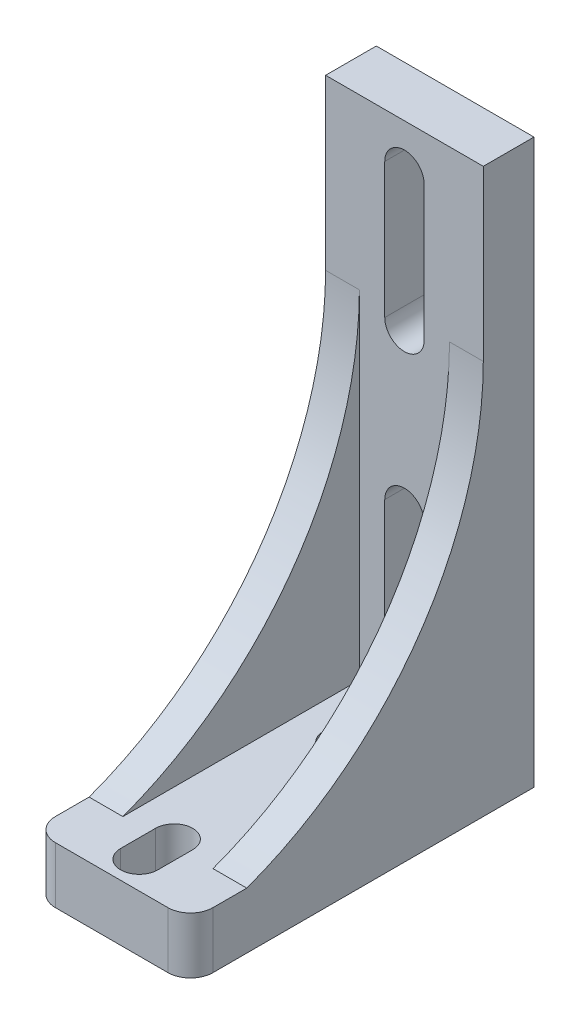
ISO-10303-21;
HEADER;
FILE_DESCRIPTION(('STEP AP214'),'2;1');
FILE_NAME('part.step','',(''),(''),'','','');
FILE_SCHEMA(('AUTOMOTIVE_DESIGN { 1 0 10303 214 1 1 1 1 }'));
ENDSEC;
DATA;
#1=APPLICATION_CONTEXT('core data for automotive mechanical design processes');
#2=APPLICATION_PROTOCOL_DEFINITION('international standard','automotive_design',2000,#1);
#3=PRODUCT_CONTEXT('',#1,'mechanical');
#4=PRODUCT('Part','Part','',(#3));
#5=PRODUCT_RELATED_PRODUCT_CATEGORY('part','',(#4));
#6=PRODUCT_DEFINITION_FORMATION('','',#4);
#7=PRODUCT_DEFINITION_CONTEXT('part definition',#1,'design');
#8=PRODUCT_DEFINITION('design','',#6,#7);
#9=PRODUCT_DEFINITION_SHAPE('','',#8);
#10=(LENGTH_UNIT() NAMED_UNIT(*) SI_UNIT(.MILLI.,.METRE.));
#11=(NAMED_UNIT(*) PLANE_ANGLE_UNIT() SI_UNIT($,.RADIAN.));
#12=(NAMED_UNIT(*) SI_UNIT($,.STERADIAN.) SOLID_ANGLE_UNIT());
#13=UNCERTAINTY_MEASURE_WITH_UNIT(LENGTH_MEASURE(1.E-05),#10,'distance_accuracy_value','');
#14=(GEOMETRIC_REPRESENTATION_CONTEXT(3) GLOBAL_UNCERTAINTY_ASSIGNED_CONTEXT((#13)) GLOBAL_UNIT_ASSIGNED_CONTEXT((#10,
#11,#12)) REPRESENTATION_CONTEXT('',''));
#15=CARTESIAN_POINT('',(0.,0.,0.));
#16=DIRECTION('',(0.,0.,1.));
#17=DIRECTION('',(1.,0.,0.));
#18=AXIS2_PLACEMENT_3D('',#15,#16,#17);
#19=CARTESIAN_POINT('',(50.6196668472011,35.0482499596085,5.99749994229783));
#20=DIRECTION('',(-1.,0.,0.));
#21=DIRECTION('',(0.,0.,1.));
#22=AXIS2_PLACEMENT_3D('',#19,#20,#21);
#23=CYLINDRICAL_SURFACE('',#22,31.997536321035);
#24=DIRECTION('',(-1.,0.,0.));
#25=VECTOR('',#24,1.);
#26=CARTESIAN_POINT('',(50.6196668472011,35.,-26.));
#27=LINE('',#26,#25);
#28=CARTESIAN_POINT('',(14.,35.,-26.));
#29=VERTEX_POINT('',#28);
#30=CARTESIAN_POINT('',(11.,34.9999999999909,-26.));
#31=VERTEX_POINT('',#30);
#32=EDGE_CURVE('E383',#29,#31,#27,.T.);
#33=ORIENTED_EDGE('',*,*,#32,.T.);
#34=CARTESIAN_POINT('',(11.,35.0482499596085,5.99749994229784));
#35=DIRECTION('',(-1.,0.,0.));
#36=DIRECTION('',(0.,0.,1.));
#37=AXIS2_PLACEMENT_3D('',#34,#35,#36);
#38=CIRCLE('',#37,31.997536321035);
#39=CARTESIAN_POINT('',(11.,5.,-5.));
#40=VERTEX_POINT('',#39);
#41=EDGE_CURVE('E492',#31,#40,#38,.T.);
#42=ORIENTED_EDGE('',*,*,#41,.T.);
#43=DIRECTION('',(-1.,0.,0.));
#44=VECTOR('',#43,1.);
#45=CARTESIAN_POINT('',(50.6196668472011,5.,-5.));
#46=LINE('',#45,#44);
#47=CARTESIAN_POINT('',(14.,5.,-5.));
#48=VERTEX_POINT('',#47);
#49=EDGE_CURVE('E374',#48,#40,#46,.T.);
#50=ORIENTED_EDGE('',*,*,#49,.F.);
#51=CARTESIAN_POINT('',(14.,35.0482499596085,5.99749994229784));
#52=DIRECTION('',(-1.,0.,0.));
#53=DIRECTION('',(0.,0.,1.));
#54=AXIS2_PLACEMENT_3D('',#51,#52,#53);
#55=CIRCLE('',#54,31.997536321035);
#56=EDGE_CURVE('E369',#29,#48,#55,.T.);
#57=ORIENTED_EDGE('',*,*,#56,.F.);
#58=EDGE_LOOP('',(#33,#42,#50,#57));
#59=FACE_BOUND('',#58,.T.);
#60=ADVANCED_FACE('F40',(#59),#23,.F.);
#61=CARTESIAN_POINT('',(3.,5.,-5.));
#62=VERTEX_POINT('',#61);
#63=CARTESIAN_POINT('',(0.,5.,-5.));
#64=VERTEX_POINT('',#63);
#65=EDGE_CURVE('E382',#62,#64,#46,.T.);
#66=ORIENTED_EDGE('',*,*,#65,.F.);
#67=CARTESIAN_POINT('',(3.,35.0482499596085,5.99749994229784));
#68=DIRECTION('',(1.,0.,0.));
#69=DIRECTION('',(0.,0.,-1.));
#70=AXIS2_PLACEMENT_3D('',#67,#68,#69);
#71=CIRCLE('',#70,31.997536321035);
#72=CARTESIAN_POINT('',(3.,34.9999999999954,-26.));
#73=VERTEX_POINT('',#72);
#74=EDGE_CURVE('E479',#62,#73,#71,.T.);
#75=ORIENTED_EDGE('',*,*,#74,.T.);
#76=CARTESIAN_POINT('',(0.,35.,-26.));
#77=VERTEX_POINT('',#76);
#78=EDGE_CURVE('E378',#73,#77,#27,.T.);
#79=ORIENTED_EDGE('',*,*,#78,.T.);
#80=CARTESIAN_POINT('',(0.,35.0482499596085,5.99749994229784));
#81=DIRECTION('',(1.,0.,0.));
#82=DIRECTION('',(0.,0.,1.));
#83=AXIS2_PLACEMENT_3D('',#80,#81,#82);
#84=CIRCLE('',#83,31.997536321035);
#85=EDGE_CURVE('E355',#64,#77,#84,.T.);
#86=ORIENTED_EDGE('',*,*,#85,.F.);
#87=EDGE_LOOP('',(#66,#75,#79,#86));
#88=FACE_BOUND('',#87,.T.);
#89=ADVANCED_FACE('F564',(#88),#23,.F.);
#90=CARTESIAN_POINT('',(0.,50.,0.));
#91=DIRECTION('',(0.,-1.,0.));
#92=DIRECTION('',(0.,0.,-1.));
#93=AXIS2_PLACEMENT_3D('',#90,#91,#92);
#94=PLANE('',#93);
#95=DIRECTION('',(0.,0.,-1.));
#96=VECTOR('',#95,1.);
#97=CARTESIAN_POINT('',(14.,50.,0.));
#98=LINE('',#97,#96);
#99=CARTESIAN_POINT('',(14.,50.,-26.));
#100=VERTEX_POINT('',#99);
#101=CARTESIAN_POINT('',(14.,50.,-30.5));
#102=VERTEX_POINT('',#101);
#103=EDGE_CURVE('E474',#100,#102,#98,.T.);
#104=ORIENTED_EDGE('',*,*,#103,.T.);
#105=DIRECTION('',(1.,0.,0.));
#106=VECTOR('',#105,1.);
#107=CARTESIAN_POINT('',(0.,50.,-30.5));
#108=LINE('',#107,#106);
#109=CARTESIAN_POINT('',(0.,50.,-30.5));
#110=VERTEX_POINT('',#109);
#111=EDGE_CURVE('E269',#110,#102,#108,.T.);
#112=ORIENTED_EDGE('',*,*,#111,.F.);
#113=DIRECTION('',(0.,0.,1.));
#114=VECTOR('',#113,1.);
#115=CARTESIAN_POINT('',(0.,50.,0.));
#116=LINE('',#115,#114);
#117=CARTESIAN_POINT('',(0.,50.,-26.));
#118=VERTEX_POINT('',#117);
#119=EDGE_CURVE('E471',#110,#118,#116,.T.);
#120=ORIENTED_EDGE('',*,*,#119,.T.);
#121=DIRECTION('',(-1.,0.,0.));
#122=VECTOR('',#121,1.);
#123=CARTESIAN_POINT('',(65.9711458407451,50.,-26.));
#124=LINE('',#123,#122);
#125=EDGE_CURVE('E464',#100,#118,#124,.T.);
#126=ORIENTED_EDGE('',*,*,#125,.F.);
#127=EDGE_LOOP('',(#104,#112,#120,#126));
#128=FACE_BOUND('',#127,.T.);
#129=ADVANCED_FACE('F601',(#128),#94,.F.);
#130=CARTESIAN_POINT('',(0.,0.,0.));
#131=DIRECTION('',(0.,-1.,0.));
#132=DIRECTION('',(0.,0.,-1.));
#133=AXIS2_PLACEMENT_3D('',#130,#131,#132);
#134=PLANE('',#133);
#135=CARTESIAN_POINT('',(7.00000000000001,0.,-20.45));
#136=DIRECTION('',(0.,-1.,0.));
#137=DIRECTION('',(0.,0.,-1.));
#138=AXIS2_PLACEMENT_3D('',#135,#136,#137);
#139=CIRCLE('',#138,1.65);
#140=CARTESIAN_POINT('',(8.65,0.,-20.45));
#141=VERTEX_POINT('',#140);
#142=CARTESIAN_POINT('',(5.35,0.,-20.45));
#143=VERTEX_POINT('',#142);
#144=EDGE_CURVE('E56',#141,#143,#139,.T.);
#145=ORIENTED_EDGE('',*,*,#144,.F.);
#146=DIRECTION('',(0.,0.,1.));
#147=VECTOR('',#146,1.);
#148=CARTESIAN_POINT('',(8.65,0.,-20.45));
#149=LINE('',#148,#147);
#150=CARTESIAN_POINT('',(8.65,0.,-23.55));
#151=VERTEX_POINT('',#150);
#152=EDGE_CURVE('E252',#151,#141,#149,.T.);
#153=ORIENTED_EDGE('',*,*,#152,.F.);
#154=CARTESIAN_POINT('',(7.00000000000001,0.,-23.55));
#155=DIRECTION('',(0.,-1.,0.));
#156=DIRECTION('',(0.,0.,-1.));
#157=AXIS2_PLACEMENT_3D('',#154,#155,#156);
#158=CIRCLE('',#157,1.65);
#159=CARTESIAN_POINT('',(5.35000000000001,0.,-23.55));
#160=VERTEX_POINT('',#159);
#161=EDGE_CURVE('E233',#160,#151,#158,.T.);
#162=ORIENTED_EDGE('',*,*,#161,.F.);
#163=DIRECTION('',(0.,0.,-1.));
#164=VECTOR('',#163,1.);
#165=CARTESIAN_POINT('',(5.35,0.,-20.45));
#166=LINE('',#165,#164);
#167=EDGE_CURVE('E244',#143,#160,#166,.T.);
#168=ORIENTED_EDGE('',*,*,#167,.F.);
#169=EDGE_LOOP('',(#145,#153,#162,#168));
#170=FACE_BOUND('',#169,.T.);
#171=CARTESIAN_POINT('',(7.00000000000001,0.,-2.45));
#172=DIRECTION('',(0.,-1.,0.));
#173=DIRECTION('',(0.,0.,-1.));
#174=AXIS2_PLACEMENT_3D('',#171,#172,#173);
#175=CIRCLE('',#174,1.65);
#176=CARTESIAN_POINT('',(8.65,0.,-2.45));
#177=VERTEX_POINT('',#176);
#178=CARTESIAN_POINT('',(5.35,0.,-2.45));
#179=VERTEX_POINT('',#178);
#180=EDGE_CURVE('E64',#177,#179,#175,.T.);
#181=ORIENTED_EDGE('',*,*,#180,.F.);
#182=DIRECTION('',(0.,0.,1.));
#183=VECTOR('',#182,1.);
#184=CARTESIAN_POINT('',(8.65,0.,-2.45));
#185=LINE('',#184,#183);
#186=CARTESIAN_POINT('',(8.65,0.,-5.55));
#187=VERTEX_POINT('',#186);
#188=EDGE_CURVE('E293',#187,#177,#185,.T.);
#189=ORIENTED_EDGE('',*,*,#188,.F.);
#190=CARTESIAN_POINT('',(7.00000000000001,0.,-5.55));
#191=DIRECTION('',(0.,-1.,0.));
#192=DIRECTION('',(0.,0.,-1.));
#193=AXIS2_PLACEMENT_3D('',#190,#191,#192);
#194=CIRCLE('',#193,1.65);
#195=CARTESIAN_POINT('',(5.35000000000001,0.,-5.55));
#196=VERTEX_POINT('',#195);
#197=EDGE_CURVE('E289',#196,#187,#194,.T.);
#198=ORIENTED_EDGE('',*,*,#197,.F.);
#199=DIRECTION('',(0.,0.,-1.));
#200=VECTOR('',#199,1.);
#201=CARTESIAN_POINT('',(5.35,0.,-2.45));
#202=LINE('',#201,#200);
#203=EDGE_CURVE('E285',#179,#196,#202,.T.);
#204=ORIENTED_EDGE('',*,*,#203,.F.);
#205=EDGE_LOOP('',(#181,#189,#198,#204));
#206=FACE_BOUND('',#205,.T.);
#207=DIRECTION('',(1.,0.,0.));
#208=VECTOR('',#207,1.);
#209=CARTESIAN_POINT('',(0.,0.,-30.5));
#210=LINE('',#209,#208);
#211=CARTESIAN_POINT('',(0.,0.,-30.5));
#212=VERTEX_POINT('',#211);
#213=CARTESIAN_POINT('',(14.,0.,-30.5));
#214=VERTEX_POINT('',#213);
#215=EDGE_CURVE('E312',#212,#214,#210,.T.);
#216=ORIENTED_EDGE('',*,*,#215,.T.);
#217=DIRECTION('',(0.,0.,-1.));
#218=VECTOR('',#217,1.);
#219=CARTESIAN_POINT('',(14.,0.,0.));
#220=LINE('',#219,#218);
#221=CARTESIAN_POINT('',(14.,0.,-2.));
#222=VERTEX_POINT('',#221);
#223=EDGE_CURVE('E475',#222,#214,#220,.T.);
#224=ORIENTED_EDGE('',*,*,#223,.F.);
#225=CARTESIAN_POINT('',(12.,0.,-2.));
#226=DIRECTION('',(0.,-1.,0.));
#227=DIRECTION('',(0.,0.,-1.));
#228=AXIS2_PLACEMENT_3D('',#225,#226,#227);
#229=CIRCLE('',#228,2.);
#230=CARTESIAN_POINT('',(12.,0.,0.));
#231=VERTEX_POINT('',#230);
#232=EDGE_CURVE('E504',#222,#231,#229,.T.);
#233=ORIENTED_EDGE('',*,*,#232,.T.);
#234=DIRECTION('',(1.,0.,0.));
#235=VECTOR('',#234,1.);
#236=CARTESIAN_POINT('',(0.,0.,0.));
#237=LINE('',#236,#235);
#238=CARTESIAN_POINT('',(2.,0.,0.));
#239=VERTEX_POINT('',#238);
#240=EDGE_CURVE('E482',#239,#231,#237,.T.);
#241=ORIENTED_EDGE('',*,*,#240,.F.);
#242=CARTESIAN_POINT('',(2.,0.,-2.));
#243=DIRECTION('',(0.,-1.,0.));
#244=DIRECTION('',(0.,0.,-1.));
#245=AXIS2_PLACEMENT_3D('',#242,#243,#244);
#246=CIRCLE('',#245,2.);
#247=CARTESIAN_POINT('',(0.,0.,-2.));
#248=VERTEX_POINT('',#247);
#249=EDGE_CURVE('E500',#239,#248,#246,.T.);
#250=ORIENTED_EDGE('',*,*,#249,.T.);
#251=DIRECTION('',(0.,0.,1.));
#252=VECTOR('',#251,1.);
#253=CARTESIAN_POINT('',(0.,0.,0.));
#254=LINE('',#253,#252);
#255=EDGE_CURVE('E456',#212,#248,#254,.T.);
#256=ORIENTED_EDGE('',*,*,#255,.F.);
#257=EDGE_LOOP('',(#216,#224,#233,#241,#250,#256));
#258=FACE_BOUND('',#257,.T.);
#259=ADVANCED_FACE('F249',(#170,#206,#258),#134,.T.);
#260=CARTESIAN_POINT('',(0.,50.,0.));
#261=DIRECTION('',(1.,0.,0.));
#262=DIRECTION('',(0.,0.,-1.));
#263=AXIS2_PLACEMENT_3D('',#260,#261,#262);
#264=PLANE('',#263);
#265=ORIENTED_EDGE('',*,*,#119,.F.);
#266=DIRECTION('',(0.,1.,0.));
#267=VECTOR('',#266,1.);
#268=CARTESIAN_POINT('',(0.,-14.0089257261219,-30.5));
#269=LINE('',#268,#267);
#270=EDGE_CURVE('E320',#212,#110,#269,.T.);
#271=ORIENTED_EDGE('',*,*,#270,.F.);
#272=ORIENTED_EDGE('',*,*,#255,.T.);
#273=DIRECTION('',(0.,-1.,0.));
#274=VECTOR('',#273,1.);
#275=CARTESIAN_POINT('',(0.,50.,-2.));
#276=LINE('',#275,#274);
#277=CARTESIAN_POINT('',(0.,5.,-2.));
#278=VERTEX_POINT('',#277);
#279=EDGE_CURVE('E49',#248,#278,#276,.F.);
#280=ORIENTED_EDGE('',*,*,#279,.T.);
#281=DIRECTION('',(0.,0.,1.));
#282=VECTOR('',#281,1.);
#283=CARTESIAN_POINT('',(0.,5.,0.));
#284=LINE('',#283,#282);
#285=EDGE_CURVE('E460',#64,#278,#284,.T.);
#286=ORIENTED_EDGE('',*,*,#285,.F.);
#287=ORIENTED_EDGE('',*,*,#85,.T.);
#288=DIRECTION('',(0.,-1.,0.));
#289=VECTOR('',#288,1.);
#290=CARTESIAN_POINT('',(0.,50.,-26.));
#291=LINE('',#290,#289);
#292=EDGE_CURVE('E420',#118,#77,#291,.T.);
#293=ORIENTED_EDGE('',*,*,#292,.F.);
#294=EDGE_LOOP('',(#265,#271,#272,#280,#286,#287,#293));
#295=FACE_BOUND('',#294,.T.);
#296=ADVANCED_FACE('F524',(#295),#264,.F.);
#297=CARTESIAN_POINT('',(0.,50.,0.));
#298=DIRECTION('',(0.,0.,-1.));
#299=DIRECTION('',(-1.,0.,0.));
#300=AXIS2_PLACEMENT_3D('',#297,#298,#299);
#301=PLANE('',#300);
#302=ORIENTED_EDGE('',*,*,#240,.T.);
#303=DIRECTION('',(0.,-1.,0.));
#304=VECTOR('',#303,1.);
#305=CARTESIAN_POINT('',(12.,50.,0.));
#306=LINE('',#305,#304);
#307=CARTESIAN_POINT('',(12.,5.,0.));
#308=VERTEX_POINT('',#307);
#309=EDGE_CURVE('E511',#231,#308,#306,.F.);
#310=ORIENTED_EDGE('',*,*,#309,.T.);
#311=DIRECTION('',(-1.,0.,0.));
#312=VECTOR('',#311,1.);
#313=CARTESIAN_POINT('',(65.9711458407451,5.,0.));
#314=LINE('',#313,#312);
#315=CARTESIAN_POINT('',(2.,5.,0.));
#316=VERTEX_POINT('',#315);
#317=EDGE_CURVE('E453',#308,#316,#314,.T.);
#318=ORIENTED_EDGE('',*,*,#317,.T.);
#319=DIRECTION('',(0.,-1.,0.));
#320=VECTOR('',#319,1.);
#321=CARTESIAN_POINT('',(2.,50.,0.));
#322=LINE('',#321,#320);
#323=EDGE_CURVE('E507',#316,#239,#322,.T.);
#324=ORIENTED_EDGE('',*,*,#323,.T.);
#325=EDGE_LOOP('',(#302,#310,#318,#324));
#326=FACE_BOUND('',#325,.T.);
#327=ADVANCED_FACE('F538',(#326),#301,.F.);
#328=CARTESIAN_POINT('',(14.,50.,0.));
#329=DIRECTION('',(-1.,0.,0.));
#330=DIRECTION('',(0.,0.,1.));
#331=AXIS2_PLACEMENT_3D('',#328,#329,#330);
#332=PLANE('',#331);
#333=ORIENTED_EDGE('',*,*,#223,.T.);
#334=DIRECTION('',(0.,1.,0.));
#335=VECTOR('',#334,1.);
#336=CARTESIAN_POINT('',(14.,-14.0089257261219,-30.5));
#337=LINE('',#336,#335);
#338=EDGE_CURVE('E316',#214,#102,#337,.T.);
#339=ORIENTED_EDGE('',*,*,#338,.T.);
#340=ORIENTED_EDGE('',*,*,#103,.F.);
#341=DIRECTION('',(0.,1.,0.));
#342=VECTOR('',#341,1.);
#343=CARTESIAN_POINT('',(14.,50.,-26.));
#344=LINE('',#343,#342);
#345=EDGE_CURVE('E449',#29,#100,#344,.T.);
#346=ORIENTED_EDGE('',*,*,#345,.F.);
#347=ORIENTED_EDGE('',*,*,#56,.T.);
#348=DIRECTION('',(0.,0.,-1.));
#349=VECTOR('',#348,1.);
#350=CARTESIAN_POINT('',(14.,5.,0.));
#351=LINE('',#350,#349);
#352=CARTESIAN_POINT('',(14.,5.,-2.));
#353=VERTEX_POINT('',#352);
#354=EDGE_CURVE('E452',#353,#48,#351,.T.);
#355=ORIENTED_EDGE('',*,*,#354,.F.);
#356=DIRECTION('',(0.,-1.,0.));
#357=VECTOR('',#356,1.);
#358=CARTESIAN_POINT('',(14.,50.,-2.));
#359=LINE('',#358,#357);
#360=EDGE_CURVE('E496',#353,#222,#359,.T.);
#361=ORIENTED_EDGE('',*,*,#360,.T.);
#362=EDGE_LOOP('',(#333,#339,#340,#346,#347,#355,#361));
#363=FACE_BOUND('',#362,.T.);
#364=ADVANCED_FACE('F548',(#363),#332,.F.);
#365=CARTESIAN_POINT('',(65.9711458407451,5.,0.));
#366=DIRECTION('',(0.,-1.,0.));
#367=DIRECTION('',(0.,0.,-1.));
#368=AXIS2_PLACEMENT_3D('',#365,#366,#367);
#369=PLANE('',#368);
#370=DIRECTION('',(0.,0.,-1.));
#371=VECTOR('',#370,1.);
#372=CARTESIAN_POINT('',(8.65,5.,-20.45));
#373=LINE('',#372,#371);
#374=CARTESIAN_POINT('',(8.65,5.,-20.45));
#375=VERTEX_POINT('',#374);
#376=CARTESIAN_POINT('',(8.65000000000001,5.,-23.55));
#377=VERTEX_POINT('',#376);
#378=EDGE_CURVE('E569',#375,#377,#373,.T.);
#379=ORIENTED_EDGE('',*,*,#378,.F.);
#380=CARTESIAN_POINT('',(7.00000000000001,5.,-20.45));
#381=DIRECTION('',(0.,-1.,0.));
#382=DIRECTION('',(0.,0.,-1.));
#383=AXIS2_PLACEMENT_3D('',#380,#381,#382);
#384=CIRCLE('',#383,1.65);
#385=CARTESIAN_POINT('',(5.35,5.,-20.45));
#386=VERTEX_POINT('',#385);
#387=EDGE_CURVE('E270',#386,#375,#384,.F.);
#388=ORIENTED_EDGE('',*,*,#387,.F.);
#389=DIRECTION('',(0.,0.,1.));
#390=VECTOR('',#389,1.);
#391=CARTESIAN_POINT('',(5.35,5.,-20.45));
#392=LINE('',#391,#390);
#393=CARTESIAN_POINT('',(5.35,5.,-23.55));
#394=VERTEX_POINT('',#393);
#395=EDGE_CURVE('E266',#394,#386,#392,.T.);
#396=ORIENTED_EDGE('',*,*,#395,.F.);
#397=CARTESIAN_POINT('',(7.00000000000001,5.,-23.55));
#398=DIRECTION('',(0.,-1.,0.));
#399=DIRECTION('',(0.,0.,-1.));
#400=AXIS2_PLACEMENT_3D('',#397,#398,#399);
#401=CIRCLE('',#400,1.65);
#402=EDGE_CURVE('E236',#377,#394,#401,.F.);
#403=ORIENTED_EDGE('',*,*,#402,.F.);
#404=EDGE_LOOP('',(#379,#388,#396,#403));
#405=FACE_BOUND('',#404,.T.);
#406=DIRECTION('',(0.,0.,-1.));
#407=VECTOR('',#406,1.);
#408=CARTESIAN_POINT('',(8.65,5.,-2.45));
#409=LINE('',#408,#407);
#410=CARTESIAN_POINT('',(8.65,5.,-2.45));
#411=VERTEX_POINT('',#410);
#412=CARTESIAN_POINT('',(8.65000000000001,5.,-5.55));
#413=VERTEX_POINT('',#412);
#414=EDGE_CURVE('E275',#411,#413,#409,.T.);
#415=ORIENTED_EDGE('',*,*,#414,.F.);
#416=CARTESIAN_POINT('',(7.00000000000001,5.,-2.45));
#417=DIRECTION('',(0.,-1.,0.));
#418=DIRECTION('',(0.,0.,-1.));
#419=AXIS2_PLACEMENT_3D('',#416,#417,#418);
#420=CIRCLE('',#419,1.65);
#421=CARTESIAN_POINT('',(5.35,5.,-2.45));
#422=VERTEX_POINT('',#421);
#423=EDGE_CURVE('E279',#422,#411,#420,.F.);
#424=ORIENTED_EDGE('',*,*,#423,.F.);
#425=DIRECTION('',(0.,0.,1.));
#426=VECTOR('',#425,1.);
#427=CARTESIAN_POINT('',(5.35,5.,-2.45));
#428=LINE('',#427,#426);
#429=CARTESIAN_POINT('',(5.35,5.,-5.55));
#430=VERTEX_POINT('',#429);
#431=EDGE_CURVE('E282',#430,#422,#428,.T.);
#432=ORIENTED_EDGE('',*,*,#431,.F.);
#433=CARTESIAN_POINT('',(7.00000000000001,5.,-5.55));
#434=DIRECTION('',(0.,-1.,0.));
#435=DIRECTION('',(0.,0.,-1.));
#436=AXIS2_PLACEMENT_3D('',#433,#434,#435);
#437=CIRCLE('',#436,1.65);
#438=EDGE_CURVE('E271',#413,#430,#437,.F.);
#439=ORIENTED_EDGE('',*,*,#438,.F.);
#440=EDGE_LOOP('',(#415,#424,#432,#439));
#441=FACE_BOUND('',#440,.T.);
#442=ORIENTED_EDGE('',*,*,#317,.F.);
#443=CARTESIAN_POINT('',(12.,5.,-2.));
#444=DIRECTION('',(0.,-1.,0.));
#445=DIRECTION('',(0.,0.,-1.));
#446=AXIS2_PLACEMENT_3D('',#443,#444,#445);
#447=CIRCLE('',#446,2.);
#448=EDGE_CURVE('E517',#308,#353,#447,.F.);
#449=ORIENTED_EDGE('',*,*,#448,.T.);
#450=ORIENTED_EDGE('',*,*,#354,.T.);
#451=ORIENTED_EDGE('',*,*,#49,.T.);
#452=DIRECTION('',(0.,0.,1.));
#453=VECTOR('',#452,1.);
#454=CARTESIAN_POINT('',(11.,5.,-26.));
#455=LINE('',#454,#453);
#456=CARTESIAN_POINT('',(11.,5.,-26.));
#457=VERTEX_POINT('',#456);
#458=EDGE_CURVE('E352',#457,#40,#455,.T.);
#459=ORIENTED_EDGE('',*,*,#458,.F.);
#460=DIRECTION('',(1.,0.,0.));
#461=VECTOR('',#460,1.);
#462=CARTESIAN_POINT('',(3.,5.,-26.));
#463=LINE('',#462,#461);
#464=CARTESIAN_POINT('',(3.,5.,-26.));
#465=VERTEX_POINT('',#464);
#466=EDGE_CURVE('E356',#465,#457,#463,.T.);
#467=ORIENTED_EDGE('',*,*,#466,.F.);
#468=DIRECTION('',(0.,0.,-1.));
#469=VECTOR('',#468,1.);
#470=CARTESIAN_POINT('',(3.,5.,-26.));
#471=LINE('',#470,#469);
#472=EDGE_CURVE('E360',#62,#465,#471,.T.);
#473=ORIENTED_EDGE('',*,*,#472,.F.);
#474=ORIENTED_EDGE('',*,*,#65,.T.);
#475=ORIENTED_EDGE('',*,*,#285,.T.);
#476=CARTESIAN_POINT('',(2.,5.,-2.));
#477=DIRECTION('',(0.,-1.,0.));
#478=DIRECTION('',(0.,0.,-1.));
#479=AXIS2_PLACEMENT_3D('',#476,#477,#478);
#480=CIRCLE('',#479,2.);
#481=EDGE_CURVE('E514',#278,#316,#480,.F.);
#482=ORIENTED_EDGE('',*,*,#481,.T.);
#483=EDGE_LOOP('',(#442,#449,#450,#451,#459,#467,#473,#474,#475,#482));
#484=FACE_BOUND('',#483,.T.);
#485=ADVANCED_FACE('F531',(#405,#441,#484),#369,.F.);
#486=CARTESIAN_POINT('',(65.9711458407451,50.,-26.));
#487=DIRECTION('',(0.,0.,-1.));
#488=DIRECTION('',(-1.,0.,0.));
#489=AXIS2_PLACEMENT_3D('',#486,#487,#488);
#490=PLANE('',#489);
#491=ORIENTED_EDGE('',*,*,#125,.T.);
#492=ORIENTED_EDGE('',*,*,#292,.T.);
#493=ORIENTED_EDGE('',*,*,#78,.F.);
#494=DIRECTION('',(0.,1.,0.));
#495=VECTOR('',#494,1.);
#496=CARTESIAN_POINT('',(3.,-29.3548497304238,-26.));
#497=LINE('',#496,#495);
#498=EDGE_CURVE('E363',#465,#73,#497,.T.);
#499=ORIENTED_EDGE('',*,*,#498,.F.);
#500=ORIENTED_EDGE('',*,*,#466,.T.);
#501=DIRECTION('',(0.,1.,0.));
#502=VECTOR('',#501,1.);
#503=CARTESIAN_POINT('',(11.,-29.3548497304238,-26.));
#504=LINE('',#503,#502);
#505=EDGE_CURVE('E351',#457,#31,#504,.T.);
#506=ORIENTED_EDGE('',*,*,#505,.T.);
#507=ORIENTED_EDGE('',*,*,#32,.F.);
#508=ORIENTED_EDGE('',*,*,#345,.T.);
#509=EDGE_LOOP('',(#491,#492,#493,#499,#500,#506,#507,#508));
#510=FACE_BOUND('',#509,.T.);
#511=CARTESIAN_POINT('',(6.99999999999999,46.,-26.));
#512=DIRECTION('',(0.,0.,-1.));
#513=DIRECTION('',(-1.,0.,0.));
#514=AXIS2_PLACEMENT_3D('',#511,#512,#513);
#515=CIRCLE('',#514,1.75);
#516=CARTESIAN_POINT('',(8.75,46.,-26.));
#517=VERTEX_POINT('',#516);
#518=CARTESIAN_POINT('',(5.24999999999999,46.,-26.));
#519=VERTEX_POINT('',#518);
#520=EDGE_CURVE('E421',#517,#519,#515,.F.);
#521=ORIENTED_EDGE('',*,*,#520,.F.);
#522=DIRECTION('',(0.,1.,0.));
#523=VECTOR('',#522,1.);
#524=CARTESIAN_POINT('',(8.75,34.,-26.));
#525=LINE('',#524,#523);
#526=CARTESIAN_POINT('',(8.75,34.,-26.));
#527=VERTEX_POINT('',#526);
#528=EDGE_CURVE('E425',#527,#517,#525,.T.);
#529=ORIENTED_EDGE('',*,*,#528,.F.);
#530=CARTESIAN_POINT('',(6.99999999999999,34.,-26.));
#531=DIRECTION('',(0.,0.,-1.));
#532=DIRECTION('',(-1.,0.,0.));
#533=AXIS2_PLACEMENT_3D('',#530,#531,#532);
#534=CIRCLE('',#533,1.75);
#535=CARTESIAN_POINT('',(5.24999999999999,34.,-26.));
#536=VERTEX_POINT('',#535);
#537=EDGE_CURVE('E429',#536,#527,#534,.F.);
#538=ORIENTED_EDGE('',*,*,#537,.F.);
#539=DIRECTION('',(0.,-1.,0.));
#540=VECTOR('',#539,1.);
#541=CARTESIAN_POINT('',(5.24999999999999,34.,-26.));
#542=LINE('',#541,#540);
#543=EDGE_CURVE('E416',#519,#536,#542,.T.);
#544=ORIENTED_EDGE('',*,*,#543,.F.);
#545=EDGE_LOOP('',(#521,#529,#538,#544));
#546=FACE_BOUND('',#545,.T.);
#547=CARTESIAN_POINT('',(6.99999999999999,8.,-26.));
#548=DIRECTION('',(0.,0.,-1.));
#549=DIRECTION('',(-1.,0.,0.));
#550=AXIS2_PLACEMENT_3D('',#547,#548,#549);
#551=CIRCLE('',#550,1.75);
#552=CARTESIAN_POINT('',(5.24999999999999,8.,-26.));
#553=VERTEX_POINT('',#552);
#554=CARTESIAN_POINT('',(8.75,8.,-26.));
#555=VERTEX_POINT('',#554);
#556=EDGE_CURVE('E396',#553,#555,#551,.F.);
#557=ORIENTED_EDGE('',*,*,#556,.F.);
#558=DIRECTION('',(0.,-1.,0.));
#559=VECTOR('',#558,1.);
#560=CARTESIAN_POINT('',(5.24999999999999,8.,-26.));
#561=LINE('',#560,#559);
#562=CARTESIAN_POINT('',(5.24999999999999,20.,-26.));
#563=VERTEX_POINT('',#562);
#564=EDGE_CURVE('E400',#563,#553,#561,.T.);
#565=ORIENTED_EDGE('',*,*,#564,.F.);
#566=CARTESIAN_POINT('',(6.99999999999999,20.,-26.));
#567=DIRECTION('',(0.,0.,-1.));
#568=DIRECTION('',(-1.,0.,0.));
#569=AXIS2_PLACEMENT_3D('',#566,#567,#568);
#570=CIRCLE('',#569,1.75);
#571=CARTESIAN_POINT('',(8.75,20.,-26.));
#572=VERTEX_POINT('',#571);
#573=EDGE_CURVE('E387',#572,#563,#570,.F.);
#574=ORIENTED_EDGE('',*,*,#573,.F.);
#575=DIRECTION('',(0.,1.,0.));
#576=VECTOR('',#575,1.);
#577=CARTESIAN_POINT('',(8.75,8.,-26.));
#578=LINE('',#577,#576);
#579=EDGE_CURVE('E391',#555,#572,#578,.T.);
#580=ORIENTED_EDGE('',*,*,#579,.F.);
#581=EDGE_LOOP('',(#557,#565,#574,#580));
#582=FACE_BOUND('',#581,.T.);
#583=ADVANCED_FACE('F558',(#510,#546,#582),#490,.F.);
#584=CARTESIAN_POINT('',(6.99999999999999,34.,-10.1097514179293));
#585=DIRECTION('',(0.,0.,-1.));
#586=DIRECTION('',(-1.,0.,0.));
#587=AXIS2_PLACEMENT_3D('',#584,#585,#586);
#588=CYLINDRICAL_SURFACE('',#587,1.75);
#589=DIRECTION('',(0.,0.,-1.));
#590=VECTOR('',#589,1.);
#591=CARTESIAN_POINT('',(8.75,34.,-10.1097514179293));
#592=LINE('',#591,#590);
#593=CARTESIAN_POINT('',(8.75,34.,-30.5));
#594=VERTEX_POINT('',#593);
#595=EDGE_CURVE('E426',#527,#594,#592,.T.);
#596=ORIENTED_EDGE('',*,*,#595,.T.);
#597=CARTESIAN_POINT('',(6.99999999999999,34.,-30.5));
#598=DIRECTION('',(0.,0.,1.));
#599=DIRECTION('',(1.,0.,0.));
#600=AXIS2_PLACEMENT_3D('',#597,#598,#599);
#601=CIRCLE('',#600,1.75);
#602=CARTESIAN_POINT('',(5.24999999999999,34.,-30.5));
#603=VERTEX_POINT('',#602);
#604=EDGE_CURVE('E347',#594,#603,#601,.F.);
#605=ORIENTED_EDGE('',*,*,#604,.T.);
#606=DIRECTION('',(0.,0.,-1.));
#607=VECTOR('',#606,1.);
#608=CARTESIAN_POINT('',(5.24999999999999,34.,-10.1097514179293));
#609=LINE('',#608,#607);
#610=EDGE_CURVE('E373',#536,#603,#609,.T.);
#611=ORIENTED_EDGE('',*,*,#610,.F.);
#612=ORIENTED_EDGE('',*,*,#537,.T.);
#613=EDGE_LOOP('',(#596,#605,#611,#612));
#614=FACE_BOUND('',#613,.T.);
#615=ADVANCED_FACE('F626',(#614),#588,.F.);
#616=CARTESIAN_POINT('',(8.75,34.,-10.1097514179293));
#617=DIRECTION('',(1.,0.,0.));
#618=DIRECTION('',(0.,0.,-1.));
#619=AXIS2_PLACEMENT_3D('',#616,#617,#618);
#620=PLANE('',#619);
#621=DIRECTION('',(0.,0.,-1.));
#622=VECTOR('',#621,1.);
#623=CARTESIAN_POINT('',(8.75,46.,-10.1097514179293));
#624=LINE('',#623,#622);
#625=CARTESIAN_POINT('',(8.75,46.,-30.5));
#626=VERTEX_POINT('',#625);
#627=EDGE_CURVE('E436',#517,#626,#624,.T.);
#628=ORIENTED_EDGE('',*,*,#627,.T.);
#629=DIRECTION('',(0.,-1.,0.));
#630=VECTOR('',#629,1.);
#631=CARTESIAN_POINT('',(8.75,34.,-30.5));
#632=LINE('',#631,#630);
#633=EDGE_CURVE('E343',#626,#594,#632,.T.);
#634=ORIENTED_EDGE('',*,*,#633,.T.);
#635=ORIENTED_EDGE('',*,*,#595,.F.);
#636=ORIENTED_EDGE('',*,*,#528,.T.);
#637=EDGE_LOOP('',(#628,#634,#635,#636));
#638=FACE_BOUND('',#637,.T.);
#639=ADVANCED_FACE('F622',(#638),#620,.F.);
#640=CARTESIAN_POINT('',(6.99999999999999,46.,-10.1097514179293));
#641=DIRECTION('',(0.,0.,-1.));
#642=DIRECTION('',(-1.,0.,0.));
#643=AXIS2_PLACEMENT_3D('',#640,#641,#642);
#644=CYLINDRICAL_SURFACE('',#643,1.75);
#645=DIRECTION('',(0.,0.,-1.));
#646=VECTOR('',#645,1.);
#647=CARTESIAN_POINT('',(5.24999999999999,46.,-10.1097514179293));
#648=LINE('',#647,#646);
#649=CARTESIAN_POINT('',(5.24999999999999,46.,-30.5));
#650=VERTEX_POINT('',#649);
#651=EDGE_CURVE('E440',#519,#650,#648,.T.);
#652=ORIENTED_EDGE('',*,*,#651,.T.);
#653=CARTESIAN_POINT('',(6.99999999999999,46.,-30.5));
#654=DIRECTION('',(0.,0.,1.));
#655=DIRECTION('',(1.,0.,0.));
#656=AXIS2_PLACEMENT_3D('',#653,#654,#655);
#657=CIRCLE('',#656,1.75);
#658=EDGE_CURVE('E339',#650,#626,#657,.F.);
#659=ORIENTED_EDGE('',*,*,#658,.T.);
#660=ORIENTED_EDGE('',*,*,#627,.F.);
#661=ORIENTED_EDGE('',*,*,#520,.T.);
#662=EDGE_LOOP('',(#652,#659,#660,#661));
#663=FACE_BOUND('',#662,.T.);
#664=ADVANCED_FACE('F625',(#663),#644,.F.);
#665=CARTESIAN_POINT('',(5.24999999999999,34.,-10.1097514179293));
#666=DIRECTION('',(-1.,0.,0.));
#667=DIRECTION('',(0.,0.,1.));
#668=AXIS2_PLACEMENT_3D('',#665,#666,#667);
#669=PLANE('',#668);
#670=ORIENTED_EDGE('',*,*,#610,.T.);
#671=DIRECTION('',(0.,1.,0.));
#672=VECTOR('',#671,1.);
#673=CARTESIAN_POINT('',(5.24999999999999,34.,-30.5));
#674=LINE('',#673,#672);
#675=EDGE_CURVE('E335',#603,#650,#674,.T.);
#676=ORIENTED_EDGE('',*,*,#675,.T.);
#677=ORIENTED_EDGE('',*,*,#651,.F.);
#678=ORIENTED_EDGE('',*,*,#543,.T.);
#679=EDGE_LOOP('',(#670,#676,#677,#678));
#680=FACE_BOUND('',#679,.T.);
#681=ADVANCED_FACE('F620',(#680),#669,.F.);
#682=CARTESIAN_POINT('',(6.99999999999999,8.,-10.1097514179293));
#683=DIRECTION('',(0.,0.,-1.));
#684=DIRECTION('',(-1.,0.,0.));
#685=AXIS2_PLACEMENT_3D('',#682,#683,#684);
#686=CYLINDRICAL_SURFACE('',#685,1.75);
#687=DIRECTION('',(0.,0.,-1.));
#688=VECTOR('',#687,1.);
#689=CARTESIAN_POINT('',(8.75,8.,-10.1097514179293));
#690=LINE('',#689,#688);
#691=CARTESIAN_POINT('',(8.75,8.,-30.5));
#692=VERTEX_POINT('',#691);
#693=EDGE_CURVE('E392',#555,#692,#690,.T.);
#694=ORIENTED_EDGE('',*,*,#693,.T.);
#695=CARTESIAN_POINT('',(6.99999999999999,8.,-30.5));
#696=DIRECTION('',(0.,0.,1.));
#697=DIRECTION('',(1.,0.,0.));
#698=AXIS2_PLACEMENT_3D('',#695,#696,#697);
#699=CIRCLE('',#698,1.75);
#700=CARTESIAN_POINT('',(5.24999999999999,8.,-30.5));
#701=VERTEX_POINT('',#700);
#702=EDGE_CURVE('E331',#692,#701,#699,.F.);
#703=ORIENTED_EDGE('',*,*,#702,.T.);
#704=DIRECTION('',(0.,0.,-1.));
#705=VECTOR('',#704,1.);
#706=CARTESIAN_POINT('',(5.24999999999999,8.,-10.1097514179293));
#707=LINE('',#706,#705);
#708=EDGE_CURVE('E412',#553,#701,#707,.T.);
#709=ORIENTED_EDGE('',*,*,#708,.F.);
#710=ORIENTED_EDGE('',*,*,#556,.T.);
#711=EDGE_LOOP('',(#694,#703,#709,#710));
#712=FACE_BOUND('',#711,.T.);
#713=ADVANCED_FACE('F609',(#712),#686,.F.);
#714=CARTESIAN_POINT('',(8.75,8.,-10.1097514179293));
#715=DIRECTION('',(1.,0.,0.));
#716=DIRECTION('',(0.,1.,0.));
#717=AXIS2_PLACEMENT_3D('',#714,#715,#716);
#718=PLANE('',#717);
#719=DIRECTION('',(0.,0.,-1.));
#720=VECTOR('',#719,1.);
#721=CARTESIAN_POINT('',(8.75,20.,-10.1097514179293));
#722=LINE('',#721,#720);
#723=CARTESIAN_POINT('',(8.75,20.,-30.5));
#724=VERTEX_POINT('',#723);
#725=EDGE_CURVE('E404',#572,#724,#722,.T.);
#726=ORIENTED_EDGE('',*,*,#725,.T.);
#727=DIRECTION('',(0.,-1.,0.));
#728=VECTOR('',#727,1.);
#729=CARTESIAN_POINT('',(8.75,8.,-30.5));
#730=LINE('',#729,#728);
#731=EDGE_CURVE('E327',#724,#692,#730,.T.);
#732=ORIENTED_EDGE('',*,*,#731,.T.);
#733=ORIENTED_EDGE('',*,*,#693,.F.);
#734=ORIENTED_EDGE('',*,*,#579,.T.);
#735=EDGE_LOOP('',(#726,#732,#733,#734));
#736=FACE_BOUND('',#735,.T.);
#737=ADVANCED_FACE('F605',(#736),#718,.F.);
#738=CARTESIAN_POINT('',(6.99999999999999,20.,-10.1097514179293));
#739=DIRECTION('',(0.,0.,-1.));
#740=DIRECTION('',(-1.,0.,0.));
#741=AXIS2_PLACEMENT_3D('',#738,#739,#740);
#742=CYLINDRICAL_SURFACE('',#741,1.75);
#743=DIRECTION('',(0.,0.,-1.));
#744=VECTOR('',#743,1.);
#745=CARTESIAN_POINT('',(5.24999999999999,20.,-10.1097514179293));
#746=LINE('',#745,#744);
#747=CARTESIAN_POINT('',(5.24999999999999,20.,-30.5));
#748=VERTEX_POINT('',#747);
#749=EDGE_CURVE('E408',#563,#748,#746,.T.);
#750=ORIENTED_EDGE('',*,*,#749,.T.);
#751=CARTESIAN_POINT('',(6.99999999999999,20.,-30.5));
#752=DIRECTION('',(0.,0.,1.));
#753=DIRECTION('',(1.,0.,0.));
#754=AXIS2_PLACEMENT_3D('',#751,#752,#753);
#755=CIRCLE('',#754,1.75);
#756=EDGE_CURVE('E323',#748,#724,#755,.F.);
#757=ORIENTED_EDGE('',*,*,#756,.T.);
#758=ORIENTED_EDGE('',*,*,#725,.F.);
#759=ORIENTED_EDGE('',*,*,#573,.T.);
#760=EDGE_LOOP('',(#750,#757,#758,#759));
#761=FACE_BOUND('',#760,.T.);
#762=ADVANCED_FACE('F608',(#761),#742,.F.);
#763=CARTESIAN_POINT('',(5.24999999999999,8.,-10.1097514179293));
#764=DIRECTION('',(-1.,0.,0.));
#765=DIRECTION('',(0.,-1.,0.));
#766=AXIS2_PLACEMENT_3D('',#763,#764,#765);
#767=PLANE('',#766);
#768=ORIENTED_EDGE('',*,*,#708,.T.);
#769=DIRECTION('',(0.,1.,0.));
#770=VECTOR('',#769,1.);
#771=CARTESIAN_POINT('',(5.24999999999999,8.,-30.5));
#772=LINE('',#771,#770);
#773=EDGE_CURVE('E12',#701,#748,#772,.T.);
#774=ORIENTED_EDGE('',*,*,#773,.T.);
#775=ORIENTED_EDGE('',*,*,#749,.F.);
#776=ORIENTED_EDGE('',*,*,#564,.T.);
#777=EDGE_LOOP('',(#768,#774,#775,#776));
#778=FACE_BOUND('',#777,.T.);
#779=ADVANCED_FACE('F613',(#778),#767,.F.);
#780=CARTESIAN_POINT('',(11.,-29.3548497304238,-26.));
#781=DIRECTION('',(-1.,0.,0.));
#782=DIRECTION('',(0.,0.,1.));
#783=AXIS2_PLACEMENT_3D('',#780,#781,#782);
#784=PLANE('',#783);
#785=ORIENTED_EDGE('',*,*,#505,.F.);
#786=ORIENTED_EDGE('',*,*,#458,.T.);
#787=ORIENTED_EDGE('',*,*,#41,.F.);
#788=EDGE_LOOP('',(#785,#786,#787));
#789=FACE_BOUND('',#788,.T.);
#790=ADVANCED_FACE('F556',(#789),#784,.T.);
#791=CARTESIAN_POINT('',(3.,-29.3548497304238,-26.));
#792=DIRECTION('',(1.,0.,0.));
#793=DIRECTION('',(0.,0.,-1.));
#794=AXIS2_PLACEMENT_3D('',#791,#792,#793);
#795=PLANE('',#794);
#796=ORIENTED_EDGE('',*,*,#472,.T.);
#797=ORIENTED_EDGE('',*,*,#498,.T.);
#798=ORIENTED_EDGE('',*,*,#74,.F.);
#799=EDGE_LOOP('',(#796,#797,#798));
#800=FACE_BOUND('',#799,.T.);
#801=ADVANCED_FACE('F652',(#800),#795,.T.);
#802=CARTESIAN_POINT('',(12.,50.,-2.));
#803=DIRECTION('',(0.,-1.,0.));
#804=DIRECTION('',(0.,0.,-1.));
#805=AXIS2_PLACEMENT_3D('',#802,#803,#804);
#806=CYLINDRICAL_SURFACE('',#805,2.);
#807=ORIENTED_EDGE('',*,*,#448,.F.);
#808=ORIENTED_EDGE('',*,*,#309,.F.);
#809=ORIENTED_EDGE('',*,*,#232,.F.);
#810=ORIENTED_EDGE('',*,*,#360,.F.);
#811=EDGE_LOOP('',(#807,#808,#809,#810));
#812=FACE_BOUND('',#811,.T.);
#813=ADVANCED_FACE('F545',(#812),#806,.T.);
#814=CARTESIAN_POINT('',(2.,50.,-2.));
#815=DIRECTION('',(0.,-1.,0.));
#816=DIRECTION('',(0.,0.,-1.));
#817=AXIS2_PLACEMENT_3D('',#814,#815,#816);
#818=CYLINDRICAL_SURFACE('',#817,2.);
#819=ORIENTED_EDGE('',*,*,#481,.F.);
#820=ORIENTED_EDGE('',*,*,#279,.F.);
#821=ORIENTED_EDGE('',*,*,#249,.F.);
#822=ORIENTED_EDGE('',*,*,#323,.F.);
#823=EDGE_LOOP('',(#819,#820,#821,#822));
#824=FACE_BOUND('',#823,.T.);
#825=ADVANCED_FACE('F42',(#824),#818,.T.);
#826=CARTESIAN_POINT('',(0.,-14.0089257261219,-30.5));
#827=DIRECTION('',(0.,0.,1.));
#828=DIRECTION('',(1.,0.,0.));
#829=AXIS2_PLACEMENT_3D('',#826,#827,#828);
#830=PLANE('',#829);
#831=ORIENTED_EDGE('',*,*,#270,.T.);
#832=ORIENTED_EDGE('',*,*,#111,.T.);
#833=ORIENTED_EDGE('',*,*,#338,.F.);
#834=ORIENTED_EDGE('',*,*,#215,.F.);
#835=EDGE_LOOP('',(#831,#832,#833,#834));
#836=FACE_BOUND('',#835,.T.);
#837=ORIENTED_EDGE('',*,*,#731,.F.);
#838=ORIENTED_EDGE('',*,*,#756,.F.);
#839=ORIENTED_EDGE('',*,*,#773,.F.);
#840=ORIENTED_EDGE('',*,*,#702,.F.);
#841=EDGE_LOOP('',(#837,#838,#839,#840));
#842=FACE_BOUND('',#841,.T.);
#843=ORIENTED_EDGE('',*,*,#633,.F.);
#844=ORIENTED_EDGE('',*,*,#658,.F.);
#845=ORIENTED_EDGE('',*,*,#675,.F.);
#846=ORIENTED_EDGE('',*,*,#604,.F.);
#847=EDGE_LOOP('',(#843,#844,#845,#846));
#848=FACE_BOUND('',#847,.T.);
#849=ADVANCED_FACE('F657',(#836,#842,#848),#830,.F.);
#850=CARTESIAN_POINT('',(7.00000000000001,12.2006944109579,-2.45));
#851=DIRECTION('',(0.,-1.,0.));
#852=DIRECTION('',(0.,0.,-1.));
#853=AXIS2_PLACEMENT_3D('',#850,#851,#852);
#854=CYLINDRICAL_SURFACE('',#853,1.65);
#855=ORIENTED_EDGE('',*,*,#423,.T.);
#856=DIRECTION('',(0.,-1.,0.));
#857=VECTOR('',#856,1.);
#858=CARTESIAN_POINT('',(8.65,12.2006944109579,-2.45));
#859=LINE('',#858,#857);
#860=EDGE_CURVE('E276',#411,#177,#859,.T.);
#861=ORIENTED_EDGE('',*,*,#860,.T.);
#862=ORIENTED_EDGE('',*,*,#180,.T.);
#863=DIRECTION('',(0.,-1.,0.));
#864=VECTOR('',#863,1.);
#865=CARTESIAN_POINT('',(5.35,12.2006944109579,-2.45));
#866=LINE('',#865,#864);
#867=EDGE_CURVE('E297',#422,#179,#866,.T.);
#868=ORIENTED_EDGE('',*,*,#867,.F.);
#869=EDGE_LOOP('',(#855,#861,#862,#868));
#870=FACE_BOUND('',#869,.T.);
#871=ADVANCED_FACE('F664',(#870),#854,.F.);
#872=CARTESIAN_POINT('',(8.65,12.2006944109579,-2.45));
#873=DIRECTION('',(1.,0.,0.));
#874=DIRECTION('',(0.,0.,-1.));
#875=AXIS2_PLACEMENT_3D('',#872,#873,#874);
#876=PLANE('',#875);
#877=ORIENTED_EDGE('',*,*,#414,.T.);
#878=DIRECTION('',(0.,-1.,0.));
#879=VECTOR('',#878,1.);
#880=CARTESIAN_POINT('',(8.65,12.2006944109579,-5.55));
#881=LINE('',#880,#879);
#882=EDGE_CURVE('E300',#413,#187,#881,.T.);
#883=ORIENTED_EDGE('',*,*,#882,.T.);
#884=ORIENTED_EDGE('',*,*,#188,.T.);
#885=ORIENTED_EDGE('',*,*,#860,.F.);
#886=EDGE_LOOP('',(#877,#883,#884,#885));
#887=FACE_BOUND('',#886,.T.);
#888=ADVANCED_FACE('F667',(#887),#876,.F.);
#889=CARTESIAN_POINT('',(7.00000000000001,12.2006944109579,-5.55));
#890=DIRECTION('',(0.,-1.,0.));
#891=DIRECTION('',(0.,0.,-1.));
#892=AXIS2_PLACEMENT_3D('',#889,#890,#891);
#893=CYLINDRICAL_SURFACE('',#892,1.65);
#894=ORIENTED_EDGE('',*,*,#438,.T.);
#895=DIRECTION('',(0.,-1.,0.));
#896=VECTOR('',#895,1.);
#897=CARTESIAN_POINT('',(5.35000000000001,12.2006944109579,-5.55));
#898=LINE('',#897,#896);
#899=EDGE_CURVE('E303',#430,#196,#898,.T.);
#900=ORIENTED_EDGE('',*,*,#899,.T.);
#901=ORIENTED_EDGE('',*,*,#197,.T.);
#902=ORIENTED_EDGE('',*,*,#882,.F.);
#903=EDGE_LOOP('',(#894,#900,#901,#902));
#904=FACE_BOUND('',#903,.T.);
#905=ADVANCED_FACE('F591',(#904),#893,.F.);
#906=CARTESIAN_POINT('',(5.35,12.2006944109579,-2.45));
#907=DIRECTION('',(-1.,0.,0.));
#908=DIRECTION('',(0.,0.,1.));
#909=AXIS2_PLACEMENT_3D('',#906,#907,#908);
#910=PLANE('',#909);
#911=ORIENTED_EDGE('',*,*,#431,.T.);
#912=ORIENTED_EDGE('',*,*,#867,.T.);
#913=ORIENTED_EDGE('',*,*,#203,.T.);
#914=ORIENTED_EDGE('',*,*,#899,.F.);
#915=EDGE_LOOP('',(#911,#912,#913,#914));
#916=FACE_BOUND('',#915,.T.);
#917=ADVANCED_FACE('F584',(#916),#910,.F.);
#918=CARTESIAN_POINT('',(7.00000000000001,12.2006944109579,-20.45));
#919=DIRECTION('',(0.,-1.,0.));
#920=DIRECTION('',(0.,0.,-1.));
#921=AXIS2_PLACEMENT_3D('',#918,#919,#920);
#922=CYLINDRICAL_SURFACE('',#921,1.65);
#923=ORIENTED_EDGE('',*,*,#387,.T.);
#924=DIRECTION('',(0.,-1.,0.));
#925=VECTOR('',#924,1.);
#926=CARTESIAN_POINT('',(8.65,12.2006944109579,-20.45));
#927=LINE('',#926,#925);
#928=EDGE_CURVE('E259',#375,#141,#927,.T.);
#929=ORIENTED_EDGE('',*,*,#928,.T.);
#930=ORIENTED_EDGE('',*,*,#144,.T.);
#931=DIRECTION('',(0.,-1.,0.));
#932=VECTOR('',#931,1.);
#933=CARTESIAN_POINT('',(5.35,12.2006944109579,-20.45));
#934=LINE('',#933,#932);
#935=EDGE_CURVE('E241',#386,#143,#934,.T.);
#936=ORIENTED_EDGE('',*,*,#935,.F.);
#937=EDGE_LOOP('',(#923,#929,#930,#936));
#938=FACE_BOUND('',#937,.T.);
#939=ADVANCED_FACE('F582',(#938),#922,.F.);
#940=CARTESIAN_POINT('',(8.65,12.2006944109579,-20.45));
#941=DIRECTION('',(1.,0.,0.));
#942=DIRECTION('',(0.,0.,-1.));
#943=AXIS2_PLACEMENT_3D('',#940,#941,#942);
#944=PLANE('',#943);
#945=ORIENTED_EDGE('',*,*,#378,.T.);
#946=DIRECTION('',(0.,-1.,0.));
#947=VECTOR('',#946,1.);
#948=CARTESIAN_POINT('',(8.65,12.2006944109579,-23.55));
#949=LINE('',#948,#947);
#950=EDGE_CURVE('E240',#377,#151,#949,.T.);
#951=ORIENTED_EDGE('',*,*,#950,.T.);
#952=ORIENTED_EDGE('',*,*,#152,.T.);
#953=ORIENTED_EDGE('',*,*,#928,.F.);
#954=EDGE_LOOP('',(#945,#951,#952,#953));
#955=FACE_BOUND('',#954,.T.);
#956=ADVANCED_FACE('F578',(#955),#944,.F.);
#957=CARTESIAN_POINT('',(7.00000000000001,12.2006944109579,-23.55));
#958=DIRECTION('',(0.,-1.,0.));
#959=DIRECTION('',(0.,0.,-1.));
#960=AXIS2_PLACEMENT_3D('',#957,#958,#959);
#961=CYLINDRICAL_SURFACE('',#960,1.65);
#962=ORIENTED_EDGE('',*,*,#402,.T.);
#963=DIRECTION('',(0.,-1.,0.));
#964=VECTOR('',#963,1.);
#965=CARTESIAN_POINT('',(5.35000000000001,12.2006944109579,-23.55));
#966=LINE('',#965,#964);
#967=EDGE_CURVE('E228',#394,#160,#966,.T.);
#968=ORIENTED_EDGE('',*,*,#967,.T.);
#969=ORIENTED_EDGE('',*,*,#161,.T.);
#970=ORIENTED_EDGE('',*,*,#950,.F.);
#971=EDGE_LOOP('',(#962,#968,#969,#970));
#972=FACE_BOUND('',#971,.T.);
#973=ADVANCED_FACE('F230',(#972),#961,.F.);
#974=CARTESIAN_POINT('',(5.35,12.2006944109579,-20.45));
#975=DIRECTION('',(-1.,0.,0.));
#976=DIRECTION('',(0.,0.,1.));
#977=AXIS2_PLACEMENT_3D('',#974,#975,#976);
#978=PLANE('',#977);
#979=ORIENTED_EDGE('',*,*,#395,.T.);
#980=ORIENTED_EDGE('',*,*,#935,.T.);
#981=ORIENTED_EDGE('',*,*,#167,.T.);
#982=ORIENTED_EDGE('',*,*,#967,.F.);
#983=EDGE_LOOP('',(#979,#980,#981,#982));
#984=FACE_BOUND('',#983,.T.);
#985=ADVANCED_FACE('F245',(#984),#978,.F.);
#986=CLOSED_SHELL('',(#60,#89,#129,#259,#296,#327,#364,#485,#583,#615,#639,#664,#681,#713,#737,
#762,#779,#790,#801,#813,#825,#849,#871,#888,#905,#917,#939,#956,#973,#985));
#987=MANIFOLD_SOLID_BREP('B2',#986);
#988=ADVANCED_BREP_SHAPE_REPRESENTATION('',(#18,#987),#14);
#989=SHAPE_DEFINITION_REPRESENTATION(#9,#988);
ENDSEC;
END-ISO-10303-21;
